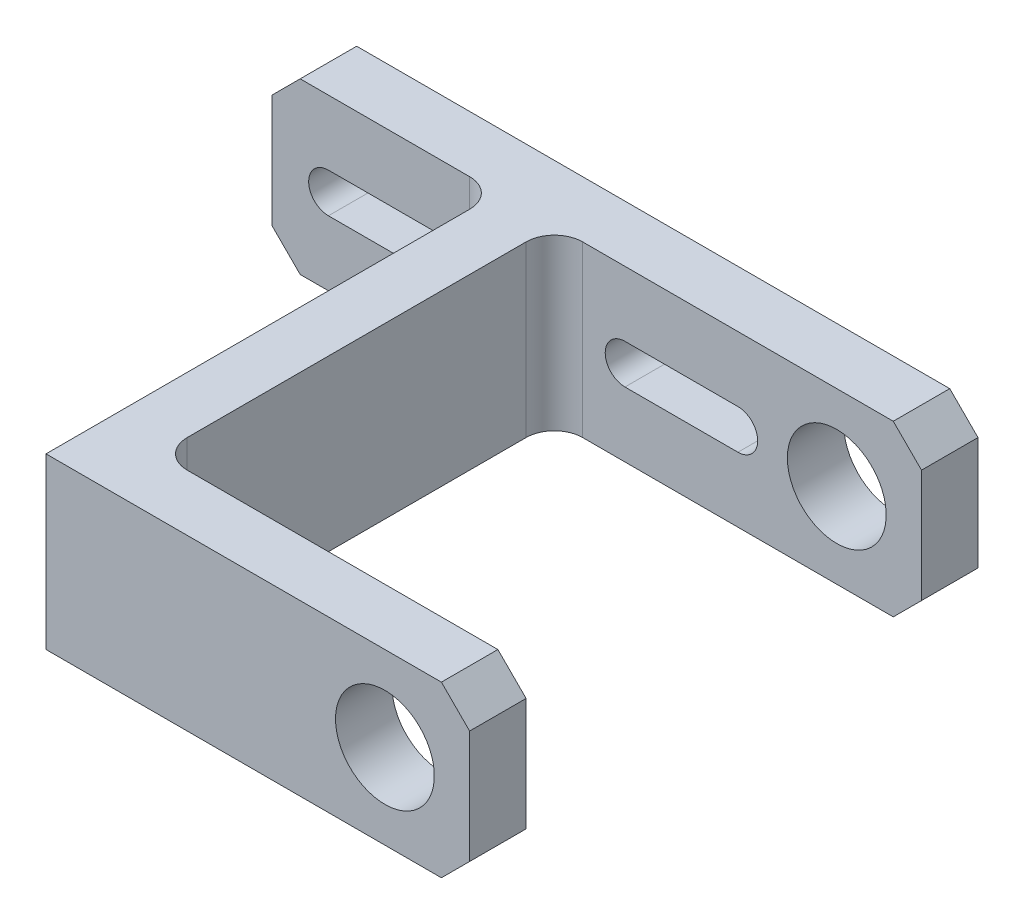
ISO-10303-21;
HEADER;
FILE_DESCRIPTION(('STEP AP214'),'2;1');
FILE_NAME('part.step','',(''),(''),'','','');
FILE_SCHEMA(('AUTOMOTIVE_DESIGN { 1 0 10303 214 1 1 1 1 }'));
ENDSEC;
DATA;
#1=APPLICATION_CONTEXT('core data for automotive mechanical design processes');
#2=APPLICATION_PROTOCOL_DEFINITION('international standard','automotive_design',2000,#1);
#3=PRODUCT_CONTEXT('',#1,'mechanical');
#4=PRODUCT('Part','Part','',(#3));
#5=PRODUCT_RELATED_PRODUCT_CATEGORY('part','',(#4));
#6=PRODUCT_DEFINITION_FORMATION('','',#4);
#7=PRODUCT_DEFINITION_CONTEXT('part definition',#1,'design');
#8=PRODUCT_DEFINITION('design','',#6,#7);
#9=PRODUCT_DEFINITION_SHAPE('','',#8);
#10=(LENGTH_UNIT() NAMED_UNIT(*) SI_UNIT(.MILLI.,.METRE.));
#11=(NAMED_UNIT(*) PLANE_ANGLE_UNIT() SI_UNIT($,.RADIAN.));
#12=(NAMED_UNIT(*) SI_UNIT($,.STERADIAN.) SOLID_ANGLE_UNIT());
#13=UNCERTAINTY_MEASURE_WITH_UNIT(LENGTH_MEASURE(1.E-05),#10,'distance_accuracy_value','');
#14=(GEOMETRIC_REPRESENTATION_CONTEXT(3) GLOBAL_UNCERTAINTY_ASSIGNED_CONTEXT((#13)) GLOBAL_UNIT_ASSIGNED_CONTEXT((#10,
#11,#12)) REPRESENTATION_CONTEXT('',''));
#15=CARTESIAN_POINT('',(0.,0.,0.));
#16=DIRECTION('',(0.,0.,1.));
#17=DIRECTION('',(1.,0.,0.));
#18=AXIS2_PLACEMENT_3D('',#15,#16,#17);
#19=CARTESIAN_POINT('',(0.,30.,-160.));
#20=DIRECTION('',(1.,0.,0.));
#21=DIRECTION('',(0.,0.,-1.));
#22=AXIS2_PLACEMENT_3D('',#19,#20,#21);
#23=PLANE('',#22);
#24=DIRECTION('',(0.,0.,1.));
#25=VECTOR('',#24,1.);
#26=CARTESIAN_POINT('',(0.,30.,-160.));
#27=LINE('',#26,#25);
#28=CARTESIAN_POINT('',(0.,30.,-150.));
#29=VERTEX_POINT('',#28);
#30=CARTESIAN_POINT('',(0.,30.,0.));
#31=VERTEX_POINT('',#30);
#32=EDGE_CURVE('E359',#29,#31,#27,.T.);
#33=ORIENTED_EDGE('',*,*,#32,.F.);
#34=DIRECTION('',(0.,-1.,0.));
#35=VECTOR('',#34,1.);
#36=CARTESIAN_POINT('',(0.,30.,-150.));
#37=LINE('',#36,#35);
#38=CARTESIAN_POINT('',(0.,-30.,-150.));
#39=VERTEX_POINT('',#38);
#40=EDGE_CURVE('E398',#29,#39,#37,.T.);
#41=ORIENTED_EDGE('',*,*,#40,.T.);
#42=DIRECTION('',(0.,0.,1.));
#43=VECTOR('',#42,1.);
#44=CARTESIAN_POINT('',(0.,-30.,-160.));
#45=LINE('',#44,#43);
#46=CARTESIAN_POINT('',(0.,-30.,0.));
#47=VERTEX_POINT('',#46);
#48=EDGE_CURVE('E345',#39,#47,#45,.T.);
#49=ORIENTED_EDGE('',*,*,#48,.T.);
#50=DIRECTION('',(0.,-1.,0.));
#51=VECTOR('',#50,1.);
#52=CARTESIAN_POINT('',(0.,30.,0.));
#53=LINE('',#52,#51);
#54=EDGE_CURVE('E394',#31,#47,#53,.T.);
#55=ORIENTED_EDGE('',*,*,#54,.F.);
#56=EDGE_LOOP('',(#33,#41,#49,#55));
#57=FACE_BOUND('',#56,.T.);
#58=ADVANCED_FACE('F45',(#57),#23,.F.);
#59=CARTESIAN_POINT('',(0.,30.,0.));
#60=DIRECTION('',(0.,0.,-1.));
#61=DIRECTION('',(-1.,0.,0.));
#62=AXIS2_PLACEMENT_3D('',#59,#60,#61);
#63=PLANE('',#62);
#64=CARTESIAN_POINT('',(120.,0.,0.));
#65=DIRECTION('',(0.,0.,-1.));
#66=DIRECTION('',(-1.,0.,0.));
#67=AXIS2_PLACEMENT_3D('',#64,#65,#66);
#68=CIRCLE('',#67,17.5);
#69=CARTESIAN_POINT('',(102.5,0.,0.));
#70=VERTEX_POINT('',#69);
#71=EDGE_CURVE('E970',#70,#70,#68,.T.);
#72=ORIENTED_EDGE('',*,*,#71,.T.);
#73=EDGE_LOOP('',(#72));
#74=FACE_BOUND('',#73,.T.);
#75=DIRECTION('',(1.,0.,0.));
#76=VECTOR('',#75,1.);
#77=CARTESIAN_POINT('',(0.,-30.,0.));
#78=LINE('',#77,#76);
#79=CARTESIAN_POINT('',(140.,-30.,0.));
#80=VERTEX_POINT('',#79);
#81=EDGE_CURVE('E377',#47,#80,#78,.T.);
#82=ORIENTED_EDGE('',*,*,#81,.T.);
#83=DIRECTION('',(0.707106781186549,0.707106781186547,0.));
#84=VECTOR('',#83,1.);
#85=CARTESIAN_POINT('',(150.,-20.,0.));
#86=LINE('',#85,#84);
#87=CARTESIAN_POINT('',(150.,-20.,0.));
#88=VERTEX_POINT('',#87);
#89=EDGE_CURVE('E466',#80,#88,#86,.T.);
#90=ORIENTED_EDGE('',*,*,#89,.T.);
#91=DIRECTION('',(0.,-1.,0.));
#92=VECTOR('',#91,1.);
#93=CARTESIAN_POINT('',(150.,30.,0.));
#94=LINE('',#93,#92);
#95=CARTESIAN_POINT('',(150.,19.9999999999999,0.));
#96=VERTEX_POINT('',#95);
#97=EDGE_CURVE('E390',#96,#88,#94,.T.);
#98=ORIENTED_EDGE('',*,*,#97,.F.);
#99=DIRECTION('',(0.707106781186548,-0.707106781186548,0.));
#100=VECTOR('',#99,1.);
#101=CARTESIAN_POINT('',(140.,30.,0.));
#102=LINE('',#101,#100);
#103=CARTESIAN_POINT('',(140.,30.,0.));
#104=VERTEX_POINT('',#103);
#105=EDGE_CURVE('E463',#96,#104,#102,.F.);
#106=ORIENTED_EDGE('',*,*,#105,.T.);
#107=DIRECTION('',(1.,0.,0.));
#108=VECTOR('',#107,1.);
#109=CARTESIAN_POINT('',(0.,30.,0.));
#110=LINE('',#109,#108);
#111=EDGE_CURVE('E362',#31,#104,#110,.T.);
#112=ORIENTED_EDGE('',*,*,#111,.F.);
#113=ORIENTED_EDGE('',*,*,#54,.T.);
#114=EDGE_LOOP('',(#82,#90,#98,#106,#112,#113));
#115=FACE_BOUND('',#114,.T.);
#116=ADVANCED_FACE('F604',(#74,#115),#63,.F.);
#117=CARTESIAN_POINT('',(150.,30.,0.));
#118=DIRECTION('',(-1.,0.,0.));
#119=DIRECTION('',(0.,0.,1.));
#120=AXIS2_PLACEMENT_3D('',#117,#118,#119);
#121=PLANE('',#120);
#122=ORIENTED_EDGE('',*,*,#97,.T.);
#123=DIRECTION('',(0.,0.,-1.));
#124=VECTOR('',#123,1.);
#125=CARTESIAN_POINT('',(150.,-20.,-20.));
#126=LINE('',#125,#124);
#127=CARTESIAN_POINT('',(150.,-20.,-20.));
#128=VERTEX_POINT('',#127);
#129=EDGE_CURVE('E443',#88,#128,#126,.T.);
#130=ORIENTED_EDGE('',*,*,#129,.T.);
#131=DIRECTION('',(0.,-1.,0.));
#132=VECTOR('',#131,1.);
#133=CARTESIAN_POINT('',(150.,30.,-20.));
#134=LINE('',#133,#132);
#135=CARTESIAN_POINT('',(150.,19.9999999999999,-20.));
#136=VERTEX_POINT('',#135);
#137=EDGE_CURVE('E374',#136,#128,#134,.T.);
#138=ORIENTED_EDGE('',*,*,#137,.F.);
#139=DIRECTION('',(0.,0.,1.));
#140=VECTOR('',#139,1.);
#141=CARTESIAN_POINT('',(150.,19.9999999999999,0.));
#142=LINE('',#141,#140);
#143=EDGE_CURVE('E440',#136,#96,#142,.T.);
#144=ORIENTED_EDGE('',*,*,#143,.T.);
#145=EDGE_LOOP('',(#122,#130,#138,#144));
#146=FACE_BOUND('',#145,.T.);
#147=ADVANCED_FACE('F572',(#146),#121,.F.);
#148=CARTESIAN_POINT('',(20.,30.,-20.));
#149=DIRECTION('',(0.,0.,1.));
#150=DIRECTION('',(1.,0.,0.));
#151=AXIS2_PLACEMENT_3D('',#148,#149,#150);
#152=PLANE('',#151);
#153=CARTESIAN_POINT('',(120.,0.,-20.));
#154=DIRECTION('',(0.,0.,1.));
#155=DIRECTION('',(1.,0.,0.));
#156=AXIS2_PLACEMENT_3D('',#153,#154,#155);
#157=CIRCLE('',#156,17.5);
#158=CARTESIAN_POINT('',(137.5,0.,-20.));
#159=VERTEX_POINT('',#158);
#160=EDGE_CURVE('E965',#159,#159,#157,.T.);
#161=ORIENTED_EDGE('',*,*,#160,.T.);
#162=EDGE_LOOP('',(#161));
#163=FACE_BOUND('',#162,.T.);
#164=ORIENTED_EDGE('',*,*,#137,.T.);
#165=DIRECTION('',(-0.707106781186549,-0.707106781186547,0.));
#166=VECTOR('',#165,1.);
#167=CARTESIAN_POINT('',(150.,-20.,-20.));
#168=LINE('',#167,#166);
#169=CARTESIAN_POINT('',(140.,-30.,-20.));
#170=VERTEX_POINT('',#169);
#171=EDGE_CURVE('E450',#128,#170,#168,.T.);
#172=ORIENTED_EDGE('',*,*,#171,.T.);
#173=DIRECTION('',(-1.,0.,0.));
#174=VECTOR('',#173,1.);
#175=CARTESIAN_POINT('',(20.,-30.,-20.));
#176=LINE('',#175,#174);
#177=CARTESIAN_POINT('',(30.,-30.,-20.));
#178=VERTEX_POINT('',#177);
#179=EDGE_CURVE('E381',#170,#178,#176,.T.);
#180=ORIENTED_EDGE('',*,*,#179,.T.);
#181=DIRECTION('',(0.,-1.,0.));
#182=VECTOR('',#181,1.);
#183=CARTESIAN_POINT('',(30.,30.,-20.));
#184=LINE('',#183,#182);
#185=CARTESIAN_POINT('',(30.,30.,-20.));
#186=VERTEX_POINT('',#185);
#187=EDGE_CURVE('E417',#178,#186,#184,.F.);
#188=ORIENTED_EDGE('',*,*,#187,.T.);
#189=DIRECTION('',(-1.,0.,0.));
#190=VECTOR('',#189,1.);
#191=CARTESIAN_POINT('',(20.,30.,-20.));
#192=LINE('',#191,#190);
#193=CARTESIAN_POINT('',(140.,30.,-20.));
#194=VERTEX_POINT('',#193);
#195=EDGE_CURVE('E367',#194,#186,#192,.T.);
#196=ORIENTED_EDGE('',*,*,#195,.F.);
#197=DIRECTION('',(-0.707106781186548,0.707106781186548,0.));
#198=VECTOR('',#197,1.);
#199=CARTESIAN_POINT('',(140.,30.,-20.));
#200=LINE('',#199,#198);
#201=EDGE_CURVE('E447',#194,#136,#200,.F.);
#202=ORIENTED_EDGE('',*,*,#201,.T.);
#203=EDGE_LOOP('',(#164,#172,#180,#188,#196,#202));
#204=FACE_BOUND('',#203,.T.);
#205=ADVANCED_FACE('F570',(#163,#204),#152,.F.);
#206=CARTESIAN_POINT('',(20.,30.,-160.));
#207=DIRECTION('',(-1.,0.,0.));
#208=DIRECTION('',(0.,0.,1.));
#209=AXIS2_PLACEMENT_3D('',#206,#207,#208);
#210=PLANE('',#209);
#211=DIRECTION('',(0.,0.,-1.));
#212=VECTOR('',#211,1.);
#213=CARTESIAN_POINT('',(20.,-30.,-160.));
#214=LINE('',#213,#212);
#215=CARTESIAN_POINT('',(20.,-30.,-30.));
#216=VERTEX_POINT('',#215);
#217=CARTESIAN_POINT('',(20.,-30.,-150.));
#218=VERTEX_POINT('',#217);
#219=EDGE_CURVE('E363',#216,#218,#214,.T.);
#220=ORIENTED_EDGE('',*,*,#219,.T.);
#221=DIRECTION('',(0.,-1.,0.));
#222=VECTOR('',#221,1.);
#223=CARTESIAN_POINT('',(20.,30.,-150.));
#224=LINE('',#223,#222);
#225=CARTESIAN_POINT('',(20.,30.,-150.));
#226=VERTEX_POINT('',#225);
#227=EDGE_CURVE('E414',#218,#226,#224,.F.);
#228=ORIENTED_EDGE('',*,*,#227,.T.);
#229=DIRECTION('',(0.,0.,-1.));
#230=VECTOR('',#229,1.);
#231=CARTESIAN_POINT('',(20.,30.,-160.));
#232=LINE('',#231,#230);
#233=CARTESIAN_POINT('',(20.,30.,-30.));
#234=VERTEX_POINT('',#233);
#235=EDGE_CURVE('E370',#234,#226,#232,.T.);
#236=ORIENTED_EDGE('',*,*,#235,.F.);
#237=DIRECTION('',(0.,-1.,0.));
#238=VECTOR('',#237,1.);
#239=CARTESIAN_POINT('',(20.,-30.,-30.));
#240=LINE('',#239,#238);
#241=EDGE_CURVE('E410',#234,#216,#240,.T.);
#242=ORIENTED_EDGE('',*,*,#241,.T.);
#243=EDGE_LOOP('',(#220,#228,#236,#242));
#244=FACE_BOUND('',#243,.T.);
#245=ADVANCED_FACE('F587',(#244),#210,.F.);
#246=CARTESIAN_POINT('',(0.,30.,0.));
#247=DIRECTION('',(0.,-1.,0.));
#248=DIRECTION('',(0.,0.,-1.));
#249=AXIS2_PLACEMENT_3D('',#246,#247,#248);
#250=PLANE('',#249);
#251=ORIENTED_EDGE('',*,*,#111,.T.);
#252=DIRECTION('',(0.,0.,-1.));
#253=VECTOR('',#252,1.);
#254=CARTESIAN_POINT('',(140.,30.,0.));
#255=LINE('',#254,#253);
#256=EDGE_CURVE('E476',#104,#194,#255,.T.);
#257=ORIENTED_EDGE('',*,*,#256,.T.);
#258=ORIENTED_EDGE('',*,*,#195,.T.);
#259=CARTESIAN_POINT('',(30.,30.,-30.));
#260=DIRECTION('',(0.,-1.,0.));
#261=DIRECTION('',(0.,0.,-1.));
#262=AXIS2_PLACEMENT_3D('',#259,#260,#261);
#263=CIRCLE('',#262,10.);
#264=EDGE_CURVE('E437',#186,#234,#263,.T.);
#265=ORIENTED_EDGE('',*,*,#264,.T.);
#266=ORIENTED_EDGE('',*,*,#235,.T.);
#267=CARTESIAN_POINT('',(30.,30.,-150.));
#268=DIRECTION('',(0.,-1.,0.));
#269=DIRECTION('',(0.,0.,-1.));
#270=AXIS2_PLACEMENT_3D('',#267,#268,#269);
#271=CIRCLE('',#270,10.);
#272=CARTESIAN_POINT('',(30.,30.,-160.));
#273=VERTEX_POINT('',#272);
#274=EDGE_CURVE('E430',#226,#273,#271,.T.);
#275=ORIENTED_EDGE('',*,*,#274,.T.);
#276=DIRECTION('',(1.,0.,0.));
#277=VECTOR('',#276,1.);
#278=CARTESIAN_POINT('',(150.,30.,-160.));
#279=LINE('',#278,#277);
#280=CARTESIAN_POINT('',(140.,30.,-160.));
#281=VERTEX_POINT('',#280);
#282=EDGE_CURVE('E356',#273,#281,#279,.T.);
#283=ORIENTED_EDGE('',*,*,#282,.T.);
#284=DIRECTION('',(0.,0.,-1.));
#285=VECTOR('',#284,1.);
#286=CARTESIAN_POINT('',(140.,30.,0.));
#287=LINE('',#286,#285);
#288=CARTESIAN_POINT('',(140.,30.,-180.));
#289=VERTEX_POINT('',#288);
#290=EDGE_CURVE('E469',#281,#289,#287,.T.);
#291=ORIENTED_EDGE('',*,*,#290,.T.);
#292=DIRECTION('',(1.,0.,0.));
#293=VECTOR('',#292,1.);
#294=CARTESIAN_POINT('',(150.,30.,-180.));
#295=LINE('',#294,#293);
#296=CARTESIAN_POINT('',(-70.,30.,-180.));
#297=VERTEX_POINT('',#296);
#298=EDGE_CURVE('E341',#297,#289,#295,.T.);
#299=ORIENTED_EDGE('',*,*,#298,.F.);
#300=DIRECTION('',(0.,0.,1.));
#301=VECTOR('',#300,1.);
#302=CARTESIAN_POINT('',(-70.,30.,0.));
#303=LINE('',#302,#301);
#304=CARTESIAN_POINT('',(-70.,30.,-160.));
#305=VERTEX_POINT('',#304);
#306=EDGE_CURVE('E472',#297,#305,#303,.T.);
#307=ORIENTED_EDGE('',*,*,#306,.T.);
#308=CARTESIAN_POINT('',(-9.99999999999995,30.,-160.));
#309=VERTEX_POINT('',#308);
#310=EDGE_CURVE('E333',#305,#309,#279,.T.);
#311=ORIENTED_EDGE('',*,*,#310,.T.);
#312=CARTESIAN_POINT('',(-10.,30.,-150.));
#313=DIRECTION('',(0.,-1.,0.));
#314=DIRECTION('',(0.,0.,-1.));
#315=AXIS2_PLACEMENT_3D('',#312,#313,#314);
#316=CIRCLE('',#315,10.);
#317=EDGE_CURVE('E424',#309,#29,#316,.T.);
#318=ORIENTED_EDGE('',*,*,#317,.T.);
#319=ORIENTED_EDGE('',*,*,#32,.T.);
#320=EDGE_LOOP('',(#251,#257,#258,#265,#266,#275,#283,#291,#299,#307,#311,#318,#319));
#321=FACE_BOUND('',#320,.T.);
#322=ADVANCED_FACE('F520',(#321),#250,.F.);
#323=CARTESIAN_POINT('',(0.,-30.,0.));
#324=DIRECTION('',(0.,-1.,0.));
#325=DIRECTION('',(0.,0.,-1.));
#326=AXIS2_PLACEMENT_3D('',#323,#324,#325);
#327=PLANE('',#326);
#328=ORIENTED_EDGE('',*,*,#179,.F.);
#329=DIRECTION('',(0.,0.,1.));
#330=VECTOR('',#329,1.);
#331=CARTESIAN_POINT('',(140.,-30.,0.));
#332=LINE('',#331,#330);
#333=EDGE_CURVE('E460',#170,#80,#332,.T.);
#334=ORIENTED_EDGE('',*,*,#333,.T.);
#335=ORIENTED_EDGE('',*,*,#81,.F.);
#336=ORIENTED_EDGE('',*,*,#48,.F.);
#337=CARTESIAN_POINT('',(-10.,-30.,-150.));
#338=DIRECTION('',(0.,-1.,0.));
#339=DIRECTION('',(0.,0.,-1.));
#340=AXIS2_PLACEMENT_3D('',#337,#338,#339);
#341=CIRCLE('',#340,10.);
#342=CARTESIAN_POINT('',(-9.99999999999995,-30.,-160.));
#343=VERTEX_POINT('',#342);
#344=EDGE_CURVE('E421',#39,#343,#341,.F.);
#345=ORIENTED_EDGE('',*,*,#344,.T.);
#346=DIRECTION('',(-1.,0.,0.));
#347=VECTOR('',#346,1.);
#348=CARTESIAN_POINT('',(150.,-30.,-160.));
#349=LINE('',#348,#347);
#350=CARTESIAN_POINT('',(-69.9999999999999,-30.,-160.));
#351=VERTEX_POINT('',#350);
#352=EDGE_CURVE('E348',#343,#351,#349,.T.);
#353=ORIENTED_EDGE('',*,*,#352,.T.);
#354=DIRECTION('',(0.,0.,-1.));
#355=VECTOR('',#354,1.);
#356=CARTESIAN_POINT('',(-70.,-30.,-180.));
#357=LINE('',#356,#355);
#358=CARTESIAN_POINT('',(-69.9999999999999,-30.,-180.));
#359=VERTEX_POINT('',#358);
#360=EDGE_CURVE('E457',#351,#359,#357,.T.);
#361=ORIENTED_EDGE('',*,*,#360,.T.);
#362=DIRECTION('',(-1.,0.,0.));
#363=VECTOR('',#362,1.);
#364=CARTESIAN_POINT('',(150.,-30.,-180.));
#365=LINE('',#364,#363);
#366=CARTESIAN_POINT('',(140.,-30.,-180.));
#367=VERTEX_POINT('',#366);
#368=EDGE_CURVE('E332',#367,#359,#365,.T.);
#369=ORIENTED_EDGE('',*,*,#368,.F.);
#370=DIRECTION('',(0.,0.,1.));
#371=VECTOR('',#370,1.);
#372=CARTESIAN_POINT('',(140.,-30.,-160.));
#373=LINE('',#372,#371);
#374=CARTESIAN_POINT('',(140.,-30.,-160.));
#375=VERTEX_POINT('',#374);
#376=EDGE_CURVE('E453',#367,#375,#373,.T.);
#377=ORIENTED_EDGE('',*,*,#376,.T.);
#378=CARTESIAN_POINT('',(30.,-30.,-160.));
#379=VERTEX_POINT('',#378);
#380=EDGE_CURVE('E349',#375,#379,#349,.T.);
#381=ORIENTED_EDGE('',*,*,#380,.T.);
#382=CARTESIAN_POINT('',(30.,-30.,-150.));
#383=DIRECTION('',(0.,-1.,0.));
#384=DIRECTION('',(0.,0.,-1.));
#385=AXIS2_PLACEMENT_3D('',#382,#383,#384);
#386=CIRCLE('',#385,10.);
#387=EDGE_CURVE('E427',#379,#218,#386,.F.);
#388=ORIENTED_EDGE('',*,*,#387,.T.);
#389=ORIENTED_EDGE('',*,*,#219,.F.);
#390=CARTESIAN_POINT('',(30.,-30.,-30.));
#391=DIRECTION('',(0.,-1.,0.));
#392=DIRECTION('',(0.,0.,-1.));
#393=AXIS2_PLACEMENT_3D('',#390,#391,#392);
#394=CIRCLE('',#393,10.);
#395=EDGE_CURVE('E433',#216,#178,#394,.F.);
#396=ORIENTED_EDGE('',*,*,#395,.T.);
#397=EDGE_LOOP('',(#328,#334,#335,#336,#345,#353,#361,#369,#377,#381,#388,#389,#396));
#398=FACE_BOUND('',#397,.T.);
#399=ADVANCED_FACE('F548',(#398),#327,.T.);
#400=CARTESIAN_POINT('',(0.,0.,-160.));
#401=DIRECTION('',(0.,0.,1.));
#402=DIRECTION('',(1.,0.,0.));
#403=AXIS2_PLACEMENT_3D('',#400,#401,#402);
#404=PLANE('',#403);
#405=DIRECTION('',(-1.,0.,0.));
#406=VECTOR('',#405,1.);
#407=CARTESIAN_POINT('',(-59.9999999999999,-7.00000000000001,-160.));
#408=LINE('',#407,#406);
#409=CARTESIAN_POINT('',(-19.9999999999999,-7.00000000000001,-160.));
#410=VERTEX_POINT('',#409);
#411=CARTESIAN_POINT('',(-59.9999999999999,-7.00000000000001,-160.));
#412=VERTEX_POINT('',#411);
#413=EDGE_CURVE('E289',#410,#412,#408,.T.);
#414=ORIENTED_EDGE('',*,*,#413,.T.);
#415=CARTESIAN_POINT('',(-59.9999999999999,0.,-160.));
#416=DIRECTION('',(0.,0.,-1.));
#417=DIRECTION('',(-1.,0.,0.));
#418=AXIS2_PLACEMENT_3D('',#415,#416,#417);
#419=CIRCLE('',#418,7.00000000000001);
#420=CARTESIAN_POINT('',(-59.9999999999999,7.00000000000001,-160.));
#421=VERTEX_POINT('',#420);
#422=EDGE_CURVE('E248',#412,#421,#419,.T.);
#423=ORIENTED_EDGE('',*,*,#422,.T.);
#424=DIRECTION('',(1.,0.,0.));
#425=VECTOR('',#424,1.);
#426=CARTESIAN_POINT('',(-59.9999999999999,7.00000000000001,-160.));
#427=LINE('',#426,#425);
#428=CARTESIAN_POINT('',(-19.9999999999999,7.,-160.));
#429=VERTEX_POINT('',#428);
#430=EDGE_CURVE('E303',#421,#429,#427,.T.);
#431=ORIENTED_EDGE('',*,*,#430,.T.);
#432=CARTESIAN_POINT('',(-19.9999999999999,0.,-160.));
#433=DIRECTION('',(0.,0.,-1.));
#434=DIRECTION('',(-1.,0.,0.));
#435=AXIS2_PLACEMENT_3D('',#432,#433,#434);
#436=CIRCLE('',#435,7.00000000000001);
#437=EDGE_CURVE('E307',#429,#410,#436,.T.);
#438=ORIENTED_EDGE('',*,*,#437,.T.);
#439=EDGE_LOOP('',(#414,#423,#431,#438));
#440=FACE_BOUND('',#439,.T.);
#441=DIRECTION('',(0.,1.,0.));
#442=VECTOR('',#441,1.);
#443=CARTESIAN_POINT('',(-80.,-30.,-160.));
#444=LINE('',#443,#442);
#445=CARTESIAN_POINT('',(-80.,-20.,-160.));
#446=VERTEX_POINT('',#445);
#447=CARTESIAN_POINT('',(-80.,19.9999999999999,-160.));
#448=VERTEX_POINT('',#447);
#449=EDGE_CURVE('E352',#446,#448,#444,.T.);
#450=ORIENTED_EDGE('',*,*,#449,.F.);
#451=DIRECTION('',(0.707106781186549,-0.707106781186547,0.));
#452=VECTOR('',#451,1.);
#453=CARTESIAN_POINT('',(-49.9999999999999,-50.,-160.));
#454=LINE('',#453,#452);
#455=EDGE_CURVE('E490',#446,#351,#454,.T.);
#456=ORIENTED_EDGE('',*,*,#455,.T.);
#457=ORIENTED_EDGE('',*,*,#352,.F.);
#458=DIRECTION('',(0.,-1.,0.));
#459=VECTOR('',#458,1.);
#460=CARTESIAN_POINT('',(-10.,0.,-160.));
#461=LINE('',#460,#459);
#462=EDGE_CURVE('E402',#343,#309,#461,.F.);
#463=ORIENTED_EDGE('',*,*,#462,.T.);
#464=ORIENTED_EDGE('',*,*,#310,.F.);
#465=DIRECTION('',(0.707106781186546,0.707106781186549,0.));
#466=VECTOR('',#465,1.);
#467=CARTESIAN_POINT('',(-50.0000000000002,49.9999999999999,-160.));
#468=LINE('',#467,#466);
#469=EDGE_CURVE('E487',#305,#448,#468,.F.);
#470=ORIENTED_EDGE('',*,*,#469,.T.);
#471=EDGE_LOOP('',(#450,#456,#457,#463,#464,#470));
#472=FACE_BOUND('',#471,.T.);
#473=ADVANCED_FACE('F534',(#440,#472),#404,.T.);
#474=CARTESIAN_POINT('',(0.,0.,-180.));
#475=DIRECTION('',(0.,0.,1.));
#476=DIRECTION('',(1.,0.,0.));
#477=AXIS2_PLACEMENT_3D('',#474,#475,#476);
#478=PLANE('',#477);
#479=CARTESIAN_POINT('',(-59.9999999999999,0.,-180.));
#480=DIRECTION('',(0.,0.,-1.));
#481=DIRECTION('',(-1.,0.,0.));
#482=AXIS2_PLACEMENT_3D('',#479,#480,#481);
#483=CIRCLE('',#482,7.00000000000001);
#484=CARTESIAN_POINT('',(-59.9999999999999,-7.00000000000001,-180.));
#485=VERTEX_POINT('',#484);
#486=CARTESIAN_POINT('',(-59.9999999999999,7.00000000000001,-180.));
#487=VERTEX_POINT('',#486);
#488=EDGE_CURVE('E285',#485,#487,#483,.T.);
#489=ORIENTED_EDGE('',*,*,#488,.F.);
#490=DIRECTION('',(-1.,0.,0.));
#491=VECTOR('',#490,1.);
#492=CARTESIAN_POINT('',(-59.9999999999999,-7.00000000000001,-180.));
#493=LINE('',#492,#491);
#494=CARTESIAN_POINT('',(-19.9999999999999,-7.00000000000001,-180.));
#495=VERTEX_POINT('',#494);
#496=EDGE_CURVE('E296',#495,#485,#493,.T.);
#497=ORIENTED_EDGE('',*,*,#496,.F.);
#498=CARTESIAN_POINT('',(-19.9999999999999,0.,-180.));
#499=DIRECTION('',(0.,0.,-1.));
#500=DIRECTION('',(-1.,0.,0.));
#501=AXIS2_PLACEMENT_3D('',#498,#499,#500);
#502=CIRCLE('',#501,7.00000000000001);
#503=CARTESIAN_POINT('',(-19.9999999999999,7.,-180.));
#504=VERTEX_POINT('',#503);
#505=EDGE_CURVE('E292',#504,#495,#502,.T.);
#506=ORIENTED_EDGE('',*,*,#505,.F.);
#507=DIRECTION('',(1.,0.,0.));
#508=VECTOR('',#507,1.);
#509=CARTESIAN_POINT('',(-59.9999999999999,7.00000000000001,-180.));
#510=LINE('',#509,#508);
#511=EDGE_CURVE('E288',#487,#504,#510,.T.);
#512=ORIENTED_EDGE('',*,*,#511,.F.);
#513=EDGE_LOOP('',(#489,#497,#506,#512));
#514=FACE_BOUND('',#513,.T.);
#515=ORIENTED_EDGE('',*,*,#368,.T.);
#516=DIRECTION('',(-0.707106781186549,0.707106781186547,0.));
#517=VECTOR('',#516,1.);
#518=CARTESIAN_POINT('',(-80.,-20.,-180.));
#519=LINE('',#518,#517);
#520=CARTESIAN_POINT('',(-80.,-20.,-180.));
#521=VERTEX_POINT('',#520);
#522=EDGE_CURVE('E502',#359,#521,#519,.T.);
#523=ORIENTED_EDGE('',*,*,#522,.T.);
#524=DIRECTION('',(0.,1.,0.));
#525=VECTOR('',#524,1.);
#526=CARTESIAN_POINT('',(-80.,-30.,-180.));
#527=LINE('',#526,#525);
#528=CARTESIAN_POINT('',(-80.,19.9999999999999,-180.));
#529=VERTEX_POINT('',#528);
#530=EDGE_CURVE('E337',#521,#529,#527,.T.);
#531=ORIENTED_EDGE('',*,*,#530,.T.);
#532=DIRECTION('',(-0.707106781186546,-0.707106781186549,0.));
#533=VECTOR('',#532,1.);
#534=CARTESIAN_POINT('',(-70.,30.,-180.));
#535=LINE('',#534,#533);
#536=EDGE_CURVE('E499',#529,#297,#535,.F.);
#537=ORIENTED_EDGE('',*,*,#536,.T.);
#538=ORIENTED_EDGE('',*,*,#298,.T.);
#539=DIRECTION('',(-0.707106781186549,0.707106781186547,0.));
#540=VECTOR('',#539,1.);
#541=CARTESIAN_POINT('',(150.,20.,-180.));
#542=LINE('',#541,#540);
#543=CARTESIAN_POINT('',(150.,20.,-180.));
#544=VERTEX_POINT('',#543);
#545=EDGE_CURVE('E493',#289,#544,#542,.F.);
#546=ORIENTED_EDGE('',*,*,#545,.T.);
#547=DIRECTION('',(0.,-1.,0.));
#548=VECTOR('',#547,1.);
#549=CARTESIAN_POINT('',(150.,-30.,-180.));
#550=LINE('',#549,#548);
#551=CARTESIAN_POINT('',(150.,-19.9999999999999,-180.));
#552=VERTEX_POINT('',#551);
#553=EDGE_CURVE('E328',#544,#552,#550,.T.);
#554=ORIENTED_EDGE('',*,*,#553,.T.);
#555=DIRECTION('',(-0.707106781186548,-0.707106781186548,0.));
#556=VECTOR('',#555,1.);
#557=CARTESIAN_POINT('',(140.,-30.,-180.));
#558=LINE('',#557,#556);
#559=EDGE_CURVE('E496',#552,#367,#558,.T.);
#560=ORIENTED_EDGE('',*,*,#559,.T.);
#561=EDGE_LOOP('',(#515,#523,#531,#537,#538,#546,#554,#560));
#562=FACE_BOUND('',#561,.T.);
#563=CARTESIAN_POINT('',(45.0000000000001,0.,-180.));
#564=DIRECTION('',(0.,0.,-1.));
#565=DIRECTION('',(-1.,0.,0.));
#566=AXIS2_PLACEMENT_3D('',#563,#564,#565);
#567=CIRCLE('',#566,6.99999999999999);
#568=CARTESIAN_POINT('',(45.0000000000001,-6.99999999999999,-180.));
#569=VERTEX_POINT('',#568);
#570=CARTESIAN_POINT('',(45.0000000000001,6.99999999999998,-180.));
#571=VERTEX_POINT('',#570);
#572=EDGE_CURVE('E228',#569,#571,#567,.T.);
#573=ORIENTED_EDGE('',*,*,#572,.F.);
#574=DIRECTION('',(-1.,0.,0.));
#575=VECTOR('',#574,1.);
#576=CARTESIAN_POINT('',(45.0000000000001,-6.99999999999999,-180.));
#577=LINE('',#576,#575);
#578=CARTESIAN_POINT('',(85.0000000000001,-6.99999999999999,-180.));
#579=VERTEX_POINT('',#578);
#580=EDGE_CURVE('E259',#579,#569,#577,.T.);
#581=ORIENTED_EDGE('',*,*,#580,.F.);
#582=CARTESIAN_POINT('',(85.0000000000001,0.,-180.));
#583=DIRECTION('',(0.,0.,-1.));
#584=DIRECTION('',(-1.,0.,0.));
#585=AXIS2_PLACEMENT_3D('',#582,#583,#584);
#586=CIRCLE('',#585,6.99999999999998);
#587=CARTESIAN_POINT('',(85.0000000000001,6.99999999999999,-180.));
#588=VERTEX_POINT('',#587);
#589=EDGE_CURVE('E255',#588,#579,#586,.T.);
#590=ORIENTED_EDGE('',*,*,#589,.F.);
#591=DIRECTION('',(1.,0.,0.));
#592=VECTOR('',#591,1.);
#593=CARTESIAN_POINT('',(45.0000000000001,6.99999999999998,-180.));
#594=LINE('',#593,#592);
#595=EDGE_CURVE('E239',#571,#588,#594,.T.);
#596=ORIENTED_EDGE('',*,*,#595,.F.);
#597=EDGE_LOOP('',(#573,#581,#590,#596));
#598=FACE_BOUND('',#597,.T.);
#599=CARTESIAN_POINT('',(120.,0.,-180.));
#600=DIRECTION('',(0.,0.,-1.));
#601=DIRECTION('',(-1.,0.,0.));
#602=AXIS2_PLACEMENT_3D('',#599,#600,#601);
#603=CIRCLE('',#602,17.5);
#604=CARTESIAN_POINT('',(102.5,0.,-180.));
#605=VERTEX_POINT('',#604);
#606=EDGE_CURVE('E268',#605,#605,#603,.T.);
#607=ORIENTED_EDGE('',*,*,#606,.F.);
#608=EDGE_LOOP('',(#607));
#609=FACE_BOUND('',#608,.T.);
#610=ADVANCED_FACE('F252',(#514,#562,#598,#609),#478,.F.);
#611=DIRECTION('',(-1.,0.,0.));
#612=VECTOR('',#611,1.);
#613=CARTESIAN_POINT('',(45.0000000000001,-6.99999999999999,-160.));
#614=LINE('',#613,#612);
#615=CARTESIAN_POINT('',(85.0000000000001,-6.99999999999999,-160.));
#616=VERTEX_POINT('',#615);
#617=CARTESIAN_POINT('',(45.0000000000001,-6.99999999999999,-160.));
#618=VERTEX_POINT('',#617);
#619=EDGE_CURVE('E240',#616,#618,#614,.T.);
#620=ORIENTED_EDGE('',*,*,#619,.T.);
#621=CARTESIAN_POINT('',(45.0000000000001,0.,-160.));
#622=DIRECTION('',(0.,0.,-1.));
#623=DIRECTION('',(-1.,0.,0.));
#624=AXIS2_PLACEMENT_3D('',#621,#622,#623);
#625=CIRCLE('',#624,6.99999999999999);
#626=CARTESIAN_POINT('',(45.0000000000001,6.99999999999998,-160.));
#627=VERTEX_POINT('',#626);
#628=EDGE_CURVE('E265',#618,#627,#625,.T.);
#629=ORIENTED_EDGE('',*,*,#628,.T.);
#630=DIRECTION('',(1.,0.,0.));
#631=VECTOR('',#630,1.);
#632=CARTESIAN_POINT('',(45.0000000000001,6.99999999999998,-160.));
#633=LINE('',#632,#631);
#634=CARTESIAN_POINT('',(85.0000000000001,6.99999999999999,-160.));
#635=VERTEX_POINT('',#634);
#636=EDGE_CURVE('E246',#627,#635,#633,.T.);
#637=ORIENTED_EDGE('',*,*,#636,.T.);
#638=CARTESIAN_POINT('',(85.0000000000001,0.,-160.));
#639=DIRECTION('',(0.,0.,-1.));
#640=DIRECTION('',(-1.,0.,0.));
#641=AXIS2_PLACEMENT_3D('',#638,#639,#640);
#642=CIRCLE('',#641,6.99999999999998);
#643=EDGE_CURVE('E271',#635,#616,#642,.T.);
#644=ORIENTED_EDGE('',*,*,#643,.T.);
#645=EDGE_LOOP('',(#620,#629,#637,#644));
#646=FACE_BOUND('',#645,.T.);
#647=ORIENTED_EDGE('',*,*,#380,.F.);
#648=DIRECTION('',(0.707106781186548,0.707106781186548,0.));
#649=VECTOR('',#648,1.);
#650=CARTESIAN_POINT('',(85.,-85.,-160.));
#651=LINE('',#650,#649);
#652=CARTESIAN_POINT('',(150.,-19.9999999999999,-160.));
#653=VERTEX_POINT('',#652);
#654=EDGE_CURVE('E62',#375,#653,#651,.T.);
#655=ORIENTED_EDGE('',*,*,#654,.T.);
#656=DIRECTION('',(0.,-1.,0.));
#657=VECTOR('',#656,1.);
#658=CARTESIAN_POINT('',(150.,-30.,-160.));
#659=LINE('',#658,#657);
#660=CARTESIAN_POINT('',(150.,20.,-160.));
#661=VERTEX_POINT('',#660);
#662=EDGE_CURVE('E327',#661,#653,#659,.T.);
#663=ORIENTED_EDGE('',*,*,#662,.F.);
#664=DIRECTION('',(0.707106781186549,-0.707106781186547,0.));
#665=VECTOR('',#664,1.);
#666=CARTESIAN_POINT('',(84.9999999999998,85.,-160.));
#667=LINE('',#666,#665);
#668=EDGE_CURVE('E70',#661,#281,#667,.F.);
#669=ORIENTED_EDGE('',*,*,#668,.T.);
#670=ORIENTED_EDGE('',*,*,#282,.F.);
#671=DIRECTION('',(0.,-1.,0.));
#672=VECTOR('',#671,1.);
#673=CARTESIAN_POINT('',(30.,0.,-160.));
#674=LINE('',#673,#672);
#675=EDGE_CURVE('E406',#273,#379,#674,.T.);
#676=ORIENTED_EDGE('',*,*,#675,.T.);
#677=EDGE_LOOP('',(#647,#655,#663,#669,#670,#676));
#678=FACE_BOUND('',#677,.T.);
#679=CARTESIAN_POINT('',(120.,0.,-160.));
#680=DIRECTION('',(0.,0.,-1.));
#681=DIRECTION('',(-1.,0.,0.));
#682=AXIS2_PLACEMENT_3D('',#679,#680,#681);
#683=CIRCLE('',#682,17.5);
#684=CARTESIAN_POINT('',(102.5,0.,-160.));
#685=VERTEX_POINT('',#684);
#686=EDGE_CURVE('E963',#685,#685,#683,.T.);
#687=ORIENTED_EDGE('',*,*,#686,.T.);
#688=EDGE_LOOP('',(#687));
#689=FACE_BOUND('',#688,.T.);
#690=ADVANCED_FACE('F514',(#646,#678,#689),#404,.T.);
#691=CARTESIAN_POINT('',(150.,-30.,-180.));
#692=DIRECTION('',(-1.,0.,0.));
#693=DIRECTION('',(0.,0.,1.));
#694=AXIS2_PLACEMENT_3D('',#691,#692,#693);
#695=PLANE('',#694);
#696=ORIENTED_EDGE('',*,*,#662,.T.);
#697=DIRECTION('',(0.,0.,-1.));
#698=VECTOR('',#697,1.);
#699=CARTESIAN_POINT('',(150.,-19.9999999999999,-180.));
#700=LINE('',#699,#698);
#701=EDGE_CURVE('E11',#653,#552,#700,.T.);
#702=ORIENTED_EDGE('',*,*,#701,.T.);
#703=ORIENTED_EDGE('',*,*,#553,.F.);
#704=DIRECTION('',(0.,0.,1.));
#705=VECTOR('',#704,1.);
#706=CARTESIAN_POINT('',(150.,20.,-180.));
#707=LINE('',#706,#705);
#708=EDGE_CURVE('E55',#544,#661,#707,.T.);
#709=ORIENTED_EDGE('',*,*,#708,.T.);
#710=EDGE_LOOP('',(#696,#702,#703,#709));
#711=FACE_BOUND('',#710,.T.);
#712=ADVANCED_FACE('F511',(#711),#695,.F.);
#713=CARTESIAN_POINT('',(-80.,-30.,-180.));
#714=DIRECTION('',(1.,0.,0.));
#715=DIRECTION('',(0.,0.,-1.));
#716=AXIS2_PLACEMENT_3D('',#713,#714,#715);
#717=PLANE('',#716);
#718=ORIENTED_EDGE('',*,*,#530,.F.);
#719=DIRECTION('',(0.,0.,1.));
#720=VECTOR('',#719,1.);
#721=CARTESIAN_POINT('',(-80.,-20.,-160.));
#722=LINE('',#721,#720);
#723=EDGE_CURVE('E483',#521,#446,#722,.T.);
#724=ORIENTED_EDGE('',*,*,#723,.T.);
#725=ORIENTED_EDGE('',*,*,#449,.T.);
#726=DIRECTION('',(0.,0.,-1.));
#727=VECTOR('',#726,1.);
#728=CARTESIAN_POINT('',(-80.,19.9999999999999,-180.));
#729=LINE('',#728,#727);
#730=EDGE_CURVE('E480',#448,#529,#729,.T.);
#731=ORIENTED_EDGE('',*,*,#730,.T.);
#732=EDGE_LOOP('',(#718,#724,#725,#731));
#733=FACE_BOUND('',#732,.T.);
#734=ADVANCED_FACE('F537',(#733),#717,.F.);
#735=CARTESIAN_POINT('',(-59.9999999999999,0.,-180.));
#736=DIRECTION('',(0.,0.,1.));
#737=DIRECTION('',(1.,0.,0.));
#738=AXIS2_PLACEMENT_3D('',#735,#736,#737);
#739=CYLINDRICAL_SURFACE('',#738,7.00000000000001);
#740=ORIENTED_EDGE('',*,*,#422,.F.);
#741=DIRECTION('',(0.,0.,1.));
#742=VECTOR('',#741,1.);
#743=CARTESIAN_POINT('',(-59.9999999999999,-7.00000000000001,-180.));
#744=LINE('',#743,#742);
#745=EDGE_CURVE('E299',#485,#412,#744,.T.);
#746=ORIENTED_EDGE('',*,*,#745,.F.);
#747=ORIENTED_EDGE('',*,*,#488,.T.);
#748=DIRECTION('',(0.,0.,1.));
#749=VECTOR('',#748,1.);
#750=CARTESIAN_POINT('',(-59.9999999999999,7.00000000000001,-180.));
#751=LINE('',#750,#749);
#752=EDGE_CURVE('E323',#487,#421,#751,.T.);
#753=ORIENTED_EDGE('',*,*,#752,.T.);
#754=EDGE_LOOP('',(#740,#746,#747,#753));
#755=FACE_BOUND('',#754,.T.);
#756=ADVANCED_FACE('F806',(#755),#739,.F.);
#757=CARTESIAN_POINT('',(-59.9999999999999,7.00000000000001,-180.));
#758=DIRECTION('',(0.,-1.,0.));
#759=DIRECTION('',(1.,0.,0.));
#760=AXIS2_PLACEMENT_3D('',#757,#758,#759);
#761=PLANE('',#760);
#762=ORIENTED_EDGE('',*,*,#430,.F.);
#763=ORIENTED_EDGE('',*,*,#752,.F.);
#764=ORIENTED_EDGE('',*,*,#511,.T.);
#765=DIRECTION('',(0.,0.,1.));
#766=VECTOR('',#765,1.);
#767=CARTESIAN_POINT('',(-19.9999999999999,7.,-180.));
#768=LINE('',#767,#766);
#769=EDGE_CURVE('E320',#504,#429,#768,.T.);
#770=ORIENTED_EDGE('',*,*,#769,.T.);
#771=EDGE_LOOP('',(#762,#763,#764,#770));
#772=FACE_BOUND('',#771,.T.);
#773=ADVANCED_FACE('F796',(#772),#761,.T.);
#774=CARTESIAN_POINT('',(-19.9999999999999,0.,-180.));
#775=DIRECTION('',(0.,0.,1.));
#776=DIRECTION('',(1.,0.,0.));
#777=AXIS2_PLACEMENT_3D('',#774,#775,#776);
#778=CYLINDRICAL_SURFACE('',#777,7.00000000000001);
#779=ORIENTED_EDGE('',*,*,#437,.F.);
#780=ORIENTED_EDGE('',*,*,#769,.F.);
#781=ORIENTED_EDGE('',*,*,#505,.T.);
#782=DIRECTION('',(0.,0.,1.));
#783=VECTOR('',#782,1.);
#784=CARTESIAN_POINT('',(-19.9999999999999,-7.00000000000001,-180.));
#785=LINE('',#784,#783);
#786=EDGE_CURVE('E317',#495,#410,#785,.T.);
#787=ORIENTED_EDGE('',*,*,#786,.T.);
#788=EDGE_LOOP('',(#779,#780,#781,#787));
#789=FACE_BOUND('',#788,.T.);
#790=ADVANCED_FACE('F786',(#789),#778,.F.);
#791=CARTESIAN_POINT('',(-59.9999999999999,-7.00000000000001,-180.));
#792=DIRECTION('',(0.,1.,0.));
#793=DIRECTION('',(-1.,0.,0.));
#794=AXIS2_PLACEMENT_3D('',#791,#792,#793);
#795=PLANE('',#794);
#796=ORIENTED_EDGE('',*,*,#413,.F.);
#797=ORIENTED_EDGE('',*,*,#786,.F.);
#798=ORIENTED_EDGE('',*,*,#496,.T.);
#799=ORIENTED_EDGE('',*,*,#745,.T.);
#800=EDGE_LOOP('',(#796,#797,#798,#799));
#801=FACE_BOUND('',#800,.T.);
#802=ADVANCED_FACE('F777',(#801),#795,.T.);
#803=CARTESIAN_POINT('',(45.0000000000001,0.,-180.));
#804=DIRECTION('',(0.,0.,1.));
#805=DIRECTION('',(1.,0.,0.));
#806=AXIS2_PLACEMENT_3D('',#803,#804,#805);
#807=CYLINDRICAL_SURFACE('',#806,6.99999999999999);
#808=ORIENTED_EDGE('',*,*,#628,.F.);
#809=DIRECTION('',(0.,0.,1.));
#810=VECTOR('',#809,1.);
#811=CARTESIAN_POINT('',(45.0000000000001,-6.99999999999999,-180.));
#812=LINE('',#811,#810);
#813=EDGE_CURVE('E234',#569,#618,#812,.T.);
#814=ORIENTED_EDGE('',*,*,#813,.F.);
#815=ORIENTED_EDGE('',*,*,#572,.T.);
#816=DIRECTION('',(0.,0.,1.));
#817=VECTOR('',#816,1.);
#818=CARTESIAN_POINT('',(45.0000000000001,6.99999999999998,-180.));
#819=LINE('',#818,#817);
#820=EDGE_CURVE('E231',#571,#627,#819,.T.);
#821=ORIENTED_EDGE('',*,*,#820,.T.);
#822=EDGE_LOOP('',(#808,#814,#815,#821));
#823=FACE_BOUND('',#822,.T.);
#824=ADVANCED_FACE('F230',(#823),#807,.F.);
#825=CARTESIAN_POINT('',(45.0000000000001,6.99999999999998,-180.));
#826=DIRECTION('',(0.,-1.,0.));
#827=DIRECTION('',(1.,0.,0.));
#828=AXIS2_PLACEMENT_3D('',#825,#826,#827);
#829=PLANE('',#828);
#830=ORIENTED_EDGE('',*,*,#636,.F.);
#831=ORIENTED_EDGE('',*,*,#820,.F.);
#832=ORIENTED_EDGE('',*,*,#595,.T.);
#833=DIRECTION('',(0.,0.,1.));
#834=VECTOR('',#833,1.);
#835=CARTESIAN_POINT('',(85.0000000000001,6.99999999999999,-180.));
#836=LINE('',#835,#834);
#837=EDGE_CURVE('E249',#588,#635,#836,.T.);
#838=ORIENTED_EDGE('',*,*,#837,.T.);
#839=EDGE_LOOP('',(#830,#831,#832,#838));
#840=FACE_BOUND('',#839,.T.);
#841=ADVANCED_FACE('F243',(#840),#829,.T.);
#842=CARTESIAN_POINT('',(85.0000000000001,0.,-180.));
#843=DIRECTION('',(0.,0.,1.));
#844=DIRECTION('',(1.,0.,0.));
#845=AXIS2_PLACEMENT_3D('',#842,#843,#844);
#846=CYLINDRICAL_SURFACE('',#845,6.99999999999998);
#847=ORIENTED_EDGE('',*,*,#643,.F.);
#848=ORIENTED_EDGE('',*,*,#837,.F.);
#849=ORIENTED_EDGE('',*,*,#589,.T.);
#850=DIRECTION('',(0.,0.,1.));
#851=VECTOR('',#850,1.);
#852=CARTESIAN_POINT('',(85.0000000000001,-6.99999999999999,-180.));
#853=LINE('',#852,#851);
#854=EDGE_CURVE('E280',#579,#616,#853,.T.);
#855=ORIENTED_EDGE('',*,*,#854,.T.);
#856=EDGE_LOOP('',(#847,#848,#849,#855));
#857=FACE_BOUND('',#856,.T.);
#858=ADVANCED_FACE('F750',(#857),#846,.F.);
#859=CARTESIAN_POINT('',(45.0000000000001,-6.99999999999999,-180.));
#860=DIRECTION('',(0.,1.,0.));
#861=DIRECTION('',(-1.,0.,0.));
#862=AXIS2_PLACEMENT_3D('',#859,#860,#861);
#863=PLANE('',#862);
#864=ORIENTED_EDGE('',*,*,#619,.F.);
#865=ORIENTED_EDGE('',*,*,#854,.F.);
#866=ORIENTED_EDGE('',*,*,#580,.T.);
#867=ORIENTED_EDGE('',*,*,#813,.T.);
#868=EDGE_LOOP('',(#864,#865,#866,#867));
#869=FACE_BOUND('',#868,.T.);
#870=ADVANCED_FACE('F740',(#869),#863,.T.);
#871=CARTESIAN_POINT('',(120.,0.,-180.));
#872=DIRECTION('',(0.,0.,1.));
#873=DIRECTION('',(1.,0.,0.));
#874=AXIS2_PLACEMENT_3D('',#871,#872,#873);
#875=CYLINDRICAL_SURFACE('',#874,17.5);
#876=ORIENTED_EDGE('',*,*,#606,.T.);
#877=EDGE_LOOP('',(#876));
#878=FACE_BOUND('',#877,.T.);
#879=ORIENTED_EDGE('',*,*,#686,.F.);
#880=EDGE_LOOP('',(#879));
#881=FACE_BOUND('',#880,.T.);
#882=ADVANCED_FACE('F615',(#878,#881),#875,.F.);
#883=CARTESIAN_POINT('',(-10.,30.,-150.));
#884=DIRECTION('',(0.,-1.,0.));
#885=DIRECTION('',(0.,0.,-1.));
#886=AXIS2_PLACEMENT_3D('',#883,#884,#885);
#887=CYLINDRICAL_SURFACE('',#886,10.);
#888=ORIENTED_EDGE('',*,*,#317,.F.);
#889=ORIENTED_EDGE('',*,*,#462,.F.);
#890=ORIENTED_EDGE('',*,*,#344,.F.);
#891=ORIENTED_EDGE('',*,*,#40,.F.);
#892=EDGE_LOOP('',(#888,#889,#890,#891));
#893=FACE_BOUND('',#892,.T.);
#894=ADVANCED_FACE('F556',(#893),#887,.F.);
#895=CARTESIAN_POINT('',(30.,0.,-150.));
#896=DIRECTION('',(0.,-1.,0.));
#897=DIRECTION('',(0.,0.,-1.));
#898=AXIS2_PLACEMENT_3D('',#895,#896,#897);
#899=CYLINDRICAL_SURFACE('',#898,10.);
#900=ORIENTED_EDGE('',*,*,#274,.F.);
#901=ORIENTED_EDGE('',*,*,#227,.F.);
#902=ORIENTED_EDGE('',*,*,#387,.F.);
#903=ORIENTED_EDGE('',*,*,#675,.F.);
#904=EDGE_LOOP('',(#900,#901,#902,#903));
#905=FACE_BOUND('',#904,.T.);
#906=ADVANCED_FACE('F591',(#905),#899,.F.);
#907=CARTESIAN_POINT('',(30.,30.,-30.));
#908=DIRECTION('',(0.,1.,0.));
#909=DIRECTION('',(0.,0.,1.));
#910=AXIS2_PLACEMENT_3D('',#907,#908,#909);
#911=CYLINDRICAL_SURFACE('',#910,10.);
#912=ORIENTED_EDGE('',*,*,#264,.F.);
#913=ORIENTED_EDGE('',*,*,#187,.F.);
#914=ORIENTED_EDGE('',*,*,#395,.F.);
#915=ORIENTED_EDGE('',*,*,#241,.F.);
#916=EDGE_LOOP('',(#912,#913,#914,#915));
#917=FACE_BOUND('',#916,.T.);
#918=ADVANCED_FACE('F584',(#917),#911,.F.);
#919=CARTESIAN_POINT('',(150.,-20.,0.));
#920=DIRECTION('',(0.707106781186546,-0.707106781186548,0.));
#921=DIRECTION('',(0.,0.,1.));
#922=AXIS2_PLACEMENT_3D('',#919,#920,#921);
#923=PLANE('',#922);
#924=ORIENTED_EDGE('',*,*,#89,.F.);
#925=ORIENTED_EDGE('',*,*,#333,.F.);
#926=ORIENTED_EDGE('',*,*,#171,.F.);
#927=ORIENTED_EDGE('',*,*,#129,.F.);
#928=EDGE_LOOP('',(#924,#925,#926,#927));
#929=FACE_BOUND('',#928,.T.);
#930=ADVANCED_FACE('F577',(#929),#923,.T.);
#931=CARTESIAN_POINT('',(140.,30.,0.));
#932=DIRECTION('',(-0.707106781186548,-0.707106781186548,0.));
#933=DIRECTION('',(0.,0.,-1.));
#934=AXIS2_PLACEMENT_3D('',#931,#932,#933);
#935=PLANE('',#934);
#936=ORIENTED_EDGE('',*,*,#105,.F.);
#937=ORIENTED_EDGE('',*,*,#143,.F.);
#938=ORIENTED_EDGE('',*,*,#201,.F.);
#939=ORIENTED_EDGE('',*,*,#256,.F.);
#940=EDGE_LOOP('',(#936,#937,#938,#939));
#941=FACE_BOUND('',#940,.T.);
#942=ADVANCED_FACE('F566',(#941),#935,.F.);
#943=CARTESIAN_POINT('',(-80.,-20.,-180.));
#944=DIRECTION('',(-0.707106781186546,-0.707106781186548,0.));
#945=DIRECTION('',(0.,0.,-1.));
#946=AXIS2_PLACEMENT_3D('',#943,#944,#945);
#947=PLANE('',#946);
#948=ORIENTED_EDGE('',*,*,#522,.F.);
#949=ORIENTED_EDGE('',*,*,#360,.F.);
#950=ORIENTED_EDGE('',*,*,#455,.F.);
#951=ORIENTED_EDGE('',*,*,#723,.F.);
#952=EDGE_LOOP('',(#948,#949,#950,#951));
#953=FACE_BOUND('',#952,.T.);
#954=ADVANCED_FACE('F541',(#953),#947,.T.);
#955=CARTESIAN_POINT('',(-70.,30.,0.));
#956=DIRECTION('',(0.707106781186549,-0.707106781186545,0.));
#957=DIRECTION('',(0.,0.,1.));
#958=AXIS2_PLACEMENT_3D('',#955,#956,#957);
#959=PLANE('',#958);
#960=ORIENTED_EDGE('',*,*,#536,.F.);
#961=ORIENTED_EDGE('',*,*,#730,.F.);
#962=ORIENTED_EDGE('',*,*,#469,.F.);
#963=ORIENTED_EDGE('',*,*,#306,.F.);
#964=EDGE_LOOP('',(#960,#961,#962,#963));
#965=FACE_BOUND('',#964,.T.);
#966=ADVANCED_FACE('F530',(#965),#959,.F.);
#967=CARTESIAN_POINT('',(140.,-30.,0.));
#968=DIRECTION('',(0.707106781186548,-0.707106781186548,0.));
#969=DIRECTION('',(0.,0.,-1.));
#970=AXIS2_PLACEMENT_3D('',#967,#968,#969);
#971=PLANE('',#970);
#972=ORIENTED_EDGE('',*,*,#559,.F.);
#973=ORIENTED_EDGE('',*,*,#701,.F.);
#974=ORIENTED_EDGE('',*,*,#654,.F.);
#975=ORIENTED_EDGE('',*,*,#376,.F.);
#976=EDGE_LOOP('',(#972,#973,#974,#975));
#977=FACE_BOUND('',#976,.T.);
#978=ADVANCED_FACE('F594',(#977),#971,.T.);
#979=CARTESIAN_POINT('',(150.,20.,-180.));
#980=DIRECTION('',(-0.707106781186546,-0.707106781186548,0.));
#981=DIRECTION('',(0.,0.,1.));
#982=AXIS2_PLACEMENT_3D('',#979,#980,#981);
#983=PLANE('',#982);
#984=ORIENTED_EDGE('',*,*,#545,.F.);
#985=ORIENTED_EDGE('',*,*,#290,.F.);
#986=ORIENTED_EDGE('',*,*,#668,.F.);
#987=ORIENTED_EDGE('',*,*,#708,.F.);
#988=EDGE_LOOP('',(#984,#985,#986,#987));
#989=FACE_BOUND('',#988,.T.);
#990=ADVANCED_FACE('F48',(#989),#983,.F.);
#991=CARTESIAN_POINT('',(120.,0.,0.));
#992=DIRECTION('',(0.,0.,-1.));
#993=DIRECTION('',(-1.,0.,0.));
#994=AXIS2_PLACEMENT_3D('',#991,#992,#993);
#995=CYLINDRICAL_SURFACE('',#994,17.5);
#996=ORIENTED_EDGE('',*,*,#71,.F.);
#997=EDGE_LOOP('',(#996));
#998=FACE_BOUND('',#997,.T.);
#999=ORIENTED_EDGE('',*,*,#160,.F.);
#1000=EDGE_LOOP('',(#999));
#1001=FACE_BOUND('',#1000,.T.);
#1002=ADVANCED_FACE('F600',(#998,#1001),#995,.F.);
#1003=CLOSED_SHELL('',(#58,#116,#147,#205,#245,#322,#399,#473,#610,#690,#712,#734,#756,#773,
#790,#802,#824,#841,#858,#870,#882,#894,#906,#918,#930,#942,#954,#966,#978,#990,#1002));
#1004=MANIFOLD_SOLID_BREP('B2',#1003);
#1005=ADVANCED_BREP_SHAPE_REPRESENTATION('',(#18,#1004),#14);
#1006=SHAPE_DEFINITION_REPRESENTATION(#9,#1005);
ENDSEC;
END-ISO-10303-21;
